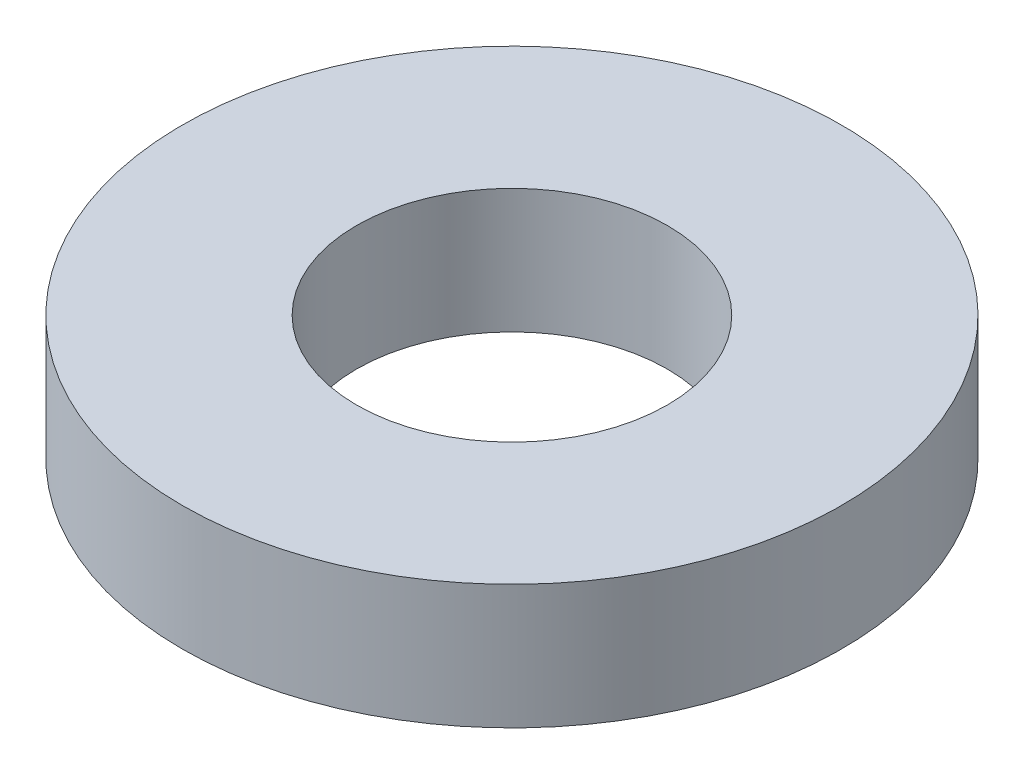
ISO-10303-21;
HEADER;
FILE_DESCRIPTION(('STEP AP214'),'2;1');
FILE_NAME('part.step','',(''),(''),'','','');
FILE_SCHEMA(('AUTOMOTIVE_DESIGN { 1 0 10303 214 1 1 1 1 }'));
ENDSEC;
DATA;
#1=APPLICATION_CONTEXT('core data for automotive mechanical design processes');
#2=APPLICATION_PROTOCOL_DEFINITION('international standard','automotive_design',2000,#1);
#3=PRODUCT_CONTEXT('',#1,'mechanical');
#4=PRODUCT('Part','Part','',(#3));
#5=PRODUCT_RELATED_PRODUCT_CATEGORY('part','',(#4));
#6=PRODUCT_DEFINITION_FORMATION('','',#4);
#7=PRODUCT_DEFINITION_CONTEXT('part definition',#1,'design');
#8=PRODUCT_DEFINITION('design','',#6,#7);
#9=PRODUCT_DEFINITION_SHAPE('','',#8);
#10=(LENGTH_UNIT() NAMED_UNIT(*) SI_UNIT(.MILLI.,.METRE.));
#11=(NAMED_UNIT(*) PLANE_ANGLE_UNIT() SI_UNIT($,.RADIAN.));
#12=(NAMED_UNIT(*) SI_UNIT($,.STERADIAN.) SOLID_ANGLE_UNIT());
#13=UNCERTAINTY_MEASURE_WITH_UNIT(LENGTH_MEASURE(1.E-05),#10,'distance_accuracy_value','');
#14=(GEOMETRIC_REPRESENTATION_CONTEXT(3) GLOBAL_UNCERTAINTY_ASSIGNED_CONTEXT((#13)) GLOBAL_UNIT_ASSIGNED_CONTEXT((#10,
#11,#12)) REPRESENTATION_CONTEXT('',''));
#15=CARTESIAN_POINT('',(0.,0.,0.));
#16=DIRECTION('',(0.,0.,1.));
#17=DIRECTION('',(1.,0.,0.));
#18=AXIS2_PLACEMENT_3D('',#15,#16,#17);
#19=CARTESIAN_POINT('',(0.,1.27,0.));
#20=DIRECTION('',(0.,1.,0.));
#21=DIRECTION('',(0.,0.,1.));
#22=AXIS2_PLACEMENT_3D('',#19,#20,#21);
#23=PLANE('',#22);
#24=CARTESIAN_POINT('',(0.,1.27,0.));
#25=DIRECTION('',(0.,1.,0.));
#26=DIRECTION('',(0.,0.,1.));
#27=AXIS2_PLACEMENT_3D('',#24,#25,#26);
#28=CIRCLE('',#27,3.3655);
#29=CARTESIAN_POINT('',(0.,1.27,3.3655));
#30=VERTEX_POINT('',#29);
#31=EDGE_CURVE('E10',#30,#30,#28,.T.);
#32=ORIENTED_EDGE('',*,*,#31,.T.);
#33=EDGE_LOOP('',(#32));
#34=FACE_BOUND('',#33,.T.);
#35=CARTESIAN_POINT('',(0.,1.27,0.));
#36=DIRECTION('',(0.,1.,0.));
#37=DIRECTION('',(0.,0.,1.));
#38=AXIS2_PLACEMENT_3D('',#35,#36,#37);
#39=CIRCLE('',#38,1.5875);
#40=CARTESIAN_POINT('',(0.,1.27,1.5875));
#41=VERTEX_POINT('',#40);
#42=EDGE_CURVE('E44',#41,#41,#39,.T.);
#43=ORIENTED_EDGE('',*,*,#42,.F.);
#44=EDGE_LOOP('',(#43));
#45=FACE_BOUND('',#44,.T.);
#46=ADVANCED_FACE('F33',(#34,#45),#23,.T.);
#47=CARTESIAN_POINT('',(0.,0.,0.));
#48=DIRECTION('',(0.,1.,0.));
#49=DIRECTION('',(0.,0.,1.));
#50=AXIS2_PLACEMENT_3D('',#47,#48,#49);
#51=PLANE('',#50);
#52=CARTESIAN_POINT('',(0.,0.,0.));
#53=DIRECTION('',(0.,1.,0.));
#54=DIRECTION('',(0.,0.,1.));
#55=AXIS2_PLACEMENT_3D('',#52,#53,#54);
#56=CIRCLE('',#55,3.3655);
#57=CARTESIAN_POINT('',(0.,0.,3.3655));
#58=VERTEX_POINT('',#57);
#59=EDGE_CURVE('E37',#58,#58,#56,.T.);
#60=ORIENTED_EDGE('',*,*,#59,.F.);
#61=EDGE_LOOP('',(#60));
#62=FACE_BOUND('',#61,.T.);
#63=CARTESIAN_POINT('',(0.,0.,0.));
#64=DIRECTION('',(0.,1.,0.));
#65=DIRECTION('',(0.,0.,1.));
#66=AXIS2_PLACEMENT_3D('',#63,#64,#65);
#67=CIRCLE('',#66,1.5875);
#68=CARTESIAN_POINT('',(0.,0.,1.5875));
#69=VERTEX_POINT('',#68);
#70=EDGE_CURVE('E46',#69,#69,#67,.T.);
#71=ORIENTED_EDGE('',*,*,#70,.T.);
#72=EDGE_LOOP('',(#71));
#73=FACE_BOUND('',#72,.T.);
#74=ADVANCED_FACE('F56',(#62,#73),#51,.F.);
#75=CARTESIAN_POINT('',(0.,1.27,0.));
#76=DIRECTION('',(0.,-1.,0.));
#77=DIRECTION('',(0.,0.,-1.));
#78=AXIS2_PLACEMENT_3D('',#75,#76,#77);
#79=CYLINDRICAL_SURFACE('',#78,3.3655);
#80=ORIENTED_EDGE('',*,*,#31,.F.);
#81=EDGE_LOOP('',(#80));
#82=FACE_BOUND('',#81,.T.);
#83=ORIENTED_EDGE('',*,*,#59,.T.);
#84=EDGE_LOOP('',(#83));
#85=FACE_BOUND('',#84,.T.);
#86=ADVANCED_FACE('F35',(#82,#85),#79,.T.);
#87=CARTESIAN_POINT('',(0.,1.27,0.));
#88=DIRECTION('',(0.,-1.,0.));
#89=DIRECTION('',(0.,0.,-1.));
#90=AXIS2_PLACEMENT_3D('',#87,#88,#89);
#91=CYLINDRICAL_SURFACE('',#90,1.5875);
#92=ORIENTED_EDGE('',*,*,#42,.T.);
#93=EDGE_LOOP('',(#92));
#94=FACE_BOUND('',#93,.T.);
#95=ORIENTED_EDGE('',*,*,#70,.F.);
#96=EDGE_LOOP('',(#95));
#97=FACE_BOUND('',#96,.T.);
#98=ADVANCED_FACE('F52',(#94,#97),#91,.F.);
#99=CLOSED_SHELL('',(#46,#74,#86,#98));
#100=MANIFOLD_SOLID_BREP('B2',#99);
#101=ADVANCED_BREP_SHAPE_REPRESENTATION('',(#18,#100),#14);
#102=SHAPE_DEFINITION_REPRESENTATION(#9,#101);
ENDSEC;
END-ISO-10303-21;
